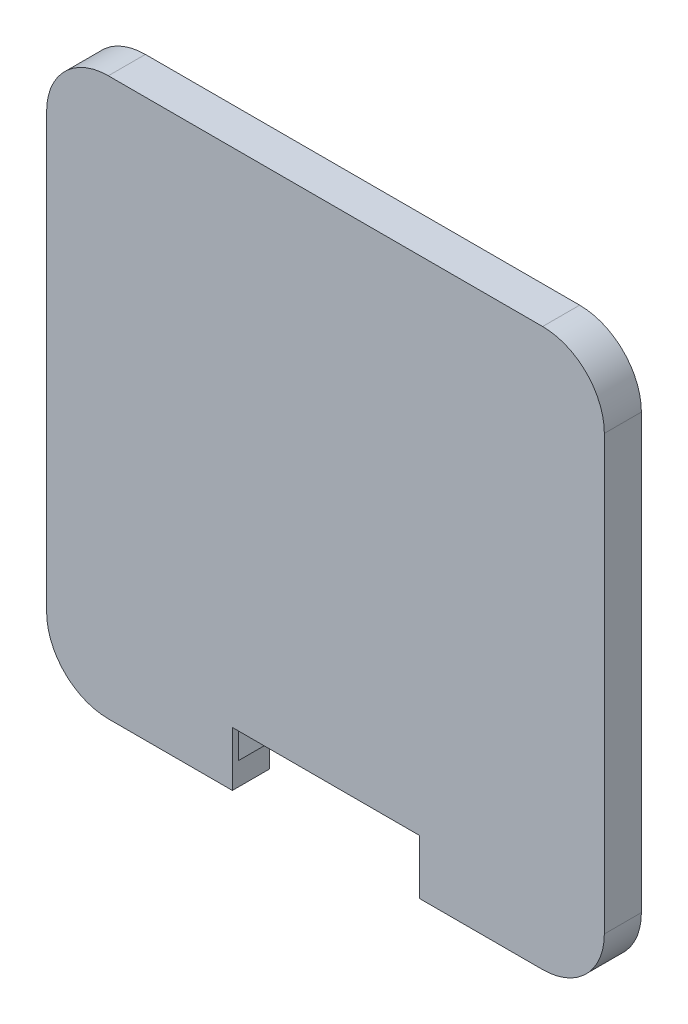
ISO-10303-21;
HEADER;
FILE_DESCRIPTION(('STEP AP214'),'2;1');
FILE_NAME('part.step','',(''),(''),'','','');
FILE_SCHEMA(('AUTOMOTIVE_DESIGN { 1 0 10303 214 1 1 1 1 }'));
ENDSEC;
DATA;
#1=APPLICATION_CONTEXT('core data for automotive mechanical design processes');
#2=APPLICATION_PROTOCOL_DEFINITION('international standard','automotive_design',2000,#1);
#3=PRODUCT_CONTEXT('',#1,'mechanical');
#4=PRODUCT('Part','Part','',(#3));
#5=PRODUCT_RELATED_PRODUCT_CATEGORY('part','',(#4));
#6=PRODUCT_DEFINITION_FORMATION('','',#4);
#7=PRODUCT_DEFINITION_CONTEXT('part definition',#1,'design');
#8=PRODUCT_DEFINITION('design','',#6,#7);
#9=PRODUCT_DEFINITION_SHAPE('','',#8);
#10=(LENGTH_UNIT() NAMED_UNIT(*) SI_UNIT(.MILLI.,.METRE.));
#11=(NAMED_UNIT(*) PLANE_ANGLE_UNIT() SI_UNIT($,.RADIAN.));
#12=(NAMED_UNIT(*) SI_UNIT($,.STERADIAN.) SOLID_ANGLE_UNIT());
#13=UNCERTAINTY_MEASURE_WITH_UNIT(LENGTH_MEASURE(1.E-05),#10,'distance_accuracy_value','');
#14=(GEOMETRIC_REPRESENTATION_CONTEXT(3) GLOBAL_UNCERTAINTY_ASSIGNED_CONTEXT((#13)) GLOBAL_UNIT_ASSIGNED_CONTEXT((#10,
#11,#12)) REPRESENTATION_CONTEXT('',''));
#15=CARTESIAN_POINT('',(0.,0.,0.));
#16=DIRECTION('',(0.,0.,1.));
#17=DIRECTION('',(1.,0.,0.));
#18=AXIS2_PLACEMENT_3D('',#15,#16,#17);
#19=CARTESIAN_POINT('',(24.9555,24.892,-5.));
#20=DIRECTION('',(0.,0.,1.));
#21=DIRECTION('',(1.,0.,0.));
#22=AXIS2_PLACEMENT_3D('',#19,#20,#21);
#23=CYLINDRICAL_SURFACE('',#22,5.23);
#24=CARTESIAN_POINT('',(24.9555,24.892,0.));
#25=DIRECTION('',(0.,0.,1.));
#26=DIRECTION('',(1.,0.,0.));
#27=AXIS2_PLACEMENT_3D('',#24,#25,#26);
#28=CIRCLE('',#27,5.23);
#29=CARTESIAN_POINT('',(30.1855,24.892,0.));
#30=VERTEX_POINT('',#29);
#31=CARTESIAN_POINT('',(24.9555,30.122,0.));
#32=VERTEX_POINT('',#31);
#33=EDGE_CURVE('E230',#30,#32,#28,.T.);
#34=ORIENTED_EDGE('',*,*,#33,.T.);
#35=DIRECTION('',(0.,0.,1.));
#36=VECTOR('',#35,1.);
#37=CARTESIAN_POINT('',(24.9555,30.122,-5.));
#38=LINE('',#37,#36);
#39=CARTESIAN_POINT('',(24.9555,30.122,-5.));
#40=VERTEX_POINT('',#39);
#41=EDGE_CURVE('E11',#40,#32,#38,.T.);
#42=ORIENTED_EDGE('',*,*,#41,.F.);
#43=CARTESIAN_POINT('',(24.9555,24.892,-5.));
#44=DIRECTION('',(0.,0.,1.));
#45=DIRECTION('',(1.,0.,0.));
#46=AXIS2_PLACEMENT_3D('',#43,#44,#45);
#47=CIRCLE('',#46,5.23);
#48=CARTESIAN_POINT('',(30.1855,24.892,-5.));
#49=VERTEX_POINT('',#48);
#50=EDGE_CURVE('E241',#49,#40,#47,.T.);
#51=ORIENTED_EDGE('',*,*,#50,.F.);
#52=DIRECTION('',(0.,0.,1.));
#53=VECTOR('',#52,1.);
#54=CARTESIAN_POINT('',(30.1855,24.892,-5.));
#55=LINE('',#54,#53);
#56=EDGE_CURVE('E44',#49,#30,#55,.T.);
#57=ORIENTED_EDGE('',*,*,#56,.T.);
#58=EDGE_LOOP('',(#34,#42,#51,#57));
#59=FACE_BOUND('',#58,.T.);
#60=ADVANCED_FACE('F41',(#59),#23,.F.);
#61=CARTESIAN_POINT('',(0.,30.122,-5.));
#62=DIRECTION('',(0.,1.,0.));
#63=DIRECTION('',(-1.,0.,0.));
#64=AXIS2_PLACEMENT_3D('',#61,#62,#63);
#65=PLANE('',#64);
#66=DIRECTION('',(-1.,0.,0.));
#67=VECTOR('',#66,1.);
#68=CARTESIAN_POINT('',(0.,30.122,0.));
#69=LINE('',#68,#67);
#70=CARTESIAN_POINT('',(-24.9555,30.122,0.));
#71=VERTEX_POINT('',#70);
#72=EDGE_CURVE('E245',#32,#71,#69,.T.);
#73=ORIENTED_EDGE('',*,*,#72,.T.);
#74=DIRECTION('',(0.,0.,1.));
#75=VECTOR('',#74,1.);
#76=CARTESIAN_POINT('',(-24.9555,30.122,-5.));
#77=LINE('',#76,#75);
#78=CARTESIAN_POINT('',(-24.9555,30.122,-5.));
#79=VERTEX_POINT('',#78);
#80=EDGE_CURVE('E51',#79,#71,#77,.T.);
#81=ORIENTED_EDGE('',*,*,#80,.F.);
#82=DIRECTION('',(-1.,0.,0.));
#83=VECTOR('',#82,1.);
#84=CARTESIAN_POINT('',(0.,30.122,-5.));
#85=LINE('',#84,#83);
#86=EDGE_CURVE('E58',#40,#79,#85,.T.);
#87=ORIENTED_EDGE('',*,*,#86,.F.);
#88=ORIENTED_EDGE('',*,*,#41,.T.);
#89=EDGE_LOOP('',(#73,#81,#87,#88));
#90=FACE_BOUND('',#89,.T.);
#91=ADVANCED_FACE('F544',(#90),#65,.F.);
#92=CARTESIAN_POINT('',(-24.9555,24.892,-5.));
#93=DIRECTION('',(0.,0.,1.));
#94=DIRECTION('',(1.,0.,0.));
#95=AXIS2_PLACEMENT_3D('',#92,#93,#94);
#96=CYLINDRICAL_SURFACE('',#95,5.23);
#97=CARTESIAN_POINT('',(-24.9555,24.892,0.));
#98=DIRECTION('',(0.,0.,1.));
#99=DIRECTION('',(1.,0.,0.));
#100=AXIS2_PLACEMENT_3D('',#97,#98,#99);
#101=CIRCLE('',#100,5.23);
#102=CARTESIAN_POINT('',(-30.1855,24.892,0.));
#103=VERTEX_POINT('',#102);
#104=EDGE_CURVE('E339',#71,#103,#101,.T.);
#105=ORIENTED_EDGE('',*,*,#104,.T.);
#106=DIRECTION('',(0.,0.,1.));
#107=VECTOR('',#106,1.);
#108=CARTESIAN_POINT('',(-30.1855,24.892,-5.));
#109=LINE('',#108,#107);
#110=CARTESIAN_POINT('',(-30.1855,24.892,-5.));
#111=VERTEX_POINT('',#110);
#112=EDGE_CURVE('E349',#111,#103,#109,.T.);
#113=ORIENTED_EDGE('',*,*,#112,.F.);
#114=CARTESIAN_POINT('',(-24.9555,24.892,-5.));
#115=DIRECTION('',(0.,0.,1.));
#116=DIRECTION('',(1.,0.,0.));
#117=AXIS2_PLACEMENT_3D('',#114,#115,#116);
#118=CIRCLE('',#117,5.23);
#119=EDGE_CURVE('E303',#79,#111,#118,.T.);
#120=ORIENTED_EDGE('',*,*,#119,.F.);
#121=ORIENTED_EDGE('',*,*,#80,.T.);
#122=EDGE_LOOP('',(#105,#113,#120,#121));
#123=FACE_BOUND('',#122,.T.);
#124=ADVANCED_FACE('F542',(#123),#96,.F.);
#125=CARTESIAN_POINT('',(-30.1855,0.,-5.));
#126=DIRECTION('',(-1.,0.,0.));
#127=DIRECTION('',(0.,0.,1.));
#128=AXIS2_PLACEMENT_3D('',#125,#126,#127);
#129=PLANE('',#128);
#130=DIRECTION('',(0.,-1.,0.));
#131=VECTOR('',#130,1.);
#132=CARTESIAN_POINT('',(-30.1855,0.,0.));
#133=LINE('',#132,#131);
#134=CARTESIAN_POINT('',(-30.1855,-24.892,0.));
#135=VERTEX_POINT('',#134);
#136=EDGE_CURVE('E335',#103,#135,#133,.T.);
#137=ORIENTED_EDGE('',*,*,#136,.T.);
#138=DIRECTION('',(0.,0.,1.));
#139=VECTOR('',#138,1.);
#140=CARTESIAN_POINT('',(-30.1855,-24.892,-5.));
#141=LINE('',#140,#139);
#142=CARTESIAN_POINT('',(-30.1855,-24.892,-5.));
#143=VERTEX_POINT('',#142);
#144=EDGE_CURVE('E353',#143,#135,#141,.T.);
#145=ORIENTED_EDGE('',*,*,#144,.F.);
#146=DIRECTION('',(0.,-1.,0.));
#147=VECTOR('',#146,1.);
#148=CARTESIAN_POINT('',(-30.1855,0.,-5.));
#149=LINE('',#148,#147);
#150=EDGE_CURVE('E300',#111,#143,#149,.T.);
#151=ORIENTED_EDGE('',*,*,#150,.F.);
#152=ORIENTED_EDGE('',*,*,#112,.T.);
#153=EDGE_LOOP('',(#137,#145,#151,#152));
#154=FACE_BOUND('',#153,.T.);
#155=ADVANCED_FACE('F538',(#154),#129,.F.);
#156=CARTESIAN_POINT('',(-24.9555,-24.892,-5.));
#157=DIRECTION('',(0.,0.,1.));
#158=DIRECTION('',(1.,0.,0.));
#159=AXIS2_PLACEMENT_3D('',#156,#157,#158);
#160=CYLINDRICAL_SURFACE('',#159,5.23);
#161=CARTESIAN_POINT('',(-24.9555,-24.892,0.));
#162=DIRECTION('',(0.,0.,1.));
#163=DIRECTION('',(1.,0.,0.));
#164=AXIS2_PLACEMENT_3D('',#161,#162,#163);
#165=CIRCLE('',#164,5.23);
#166=CARTESIAN_POINT('',(-24.9555,-30.122,0.));
#167=VERTEX_POINT('',#166);
#168=EDGE_CURVE('E331',#135,#167,#165,.T.);
#169=ORIENTED_EDGE('',*,*,#168,.T.);
#170=DIRECTION('',(0.,0.,1.));
#171=VECTOR('',#170,1.);
#172=CARTESIAN_POINT('',(-24.9555,-30.122,-5.));
#173=LINE('',#172,#171);
#174=CARTESIAN_POINT('',(-24.9555,-30.122,-5.));
#175=VERTEX_POINT('',#174);
#176=EDGE_CURVE('E357',#175,#167,#173,.T.);
#177=ORIENTED_EDGE('',*,*,#176,.F.);
#178=CARTESIAN_POINT('',(-24.9555,-24.892,-5.));
#179=DIRECTION('',(0.,0.,1.));
#180=DIRECTION('',(1.,0.,0.));
#181=AXIS2_PLACEMENT_3D('',#178,#179,#180);
#182=CIRCLE('',#181,5.23);
#183=EDGE_CURVE('E297',#143,#175,#182,.T.);
#184=ORIENTED_EDGE('',*,*,#183,.F.);
#185=ORIENTED_EDGE('',*,*,#144,.T.);
#186=EDGE_LOOP('',(#169,#177,#184,#185));
#187=FACE_BOUND('',#186,.T.);
#188=ADVANCED_FACE('F533',(#187),#160,.F.);
#189=CARTESIAN_POINT('',(0.,-30.122,-5.));
#190=DIRECTION('',(0.,-1.,0.));
#191=DIRECTION('',(1.,0.,0.));
#192=AXIS2_PLACEMENT_3D('',#189,#190,#191);
#193=PLANE('',#192);
#194=DIRECTION('',(1.,0.,0.));
#195=VECTOR('',#194,1.);
#196=CARTESIAN_POINT('',(0.,-30.122,0.));
#197=LINE('',#196,#195);
#198=CARTESIAN_POINT('',(-19.7221075529831,-30.122,0.));
#199=VERTEX_POINT('',#198);
#200=EDGE_CURVE('E327',#167,#199,#197,.T.);
#201=ORIENTED_EDGE('',*,*,#200,.T.);
#202=DIRECTION('',(0.,0.,1.));
#203=VECTOR('',#202,1.);
#204=CARTESIAN_POINT('',(-19.7221075529831,-30.122,-5.));
#205=LINE('',#204,#203);
#206=CARTESIAN_POINT('',(-19.7221075529831,-30.122,-5.));
#207=VERTEX_POINT('',#206);
#208=EDGE_CURVE('E361',#207,#199,#205,.T.);
#209=ORIENTED_EDGE('',*,*,#208,.F.);
#210=DIRECTION('',(1.,0.,0.));
#211=VECTOR('',#210,1.);
#212=CARTESIAN_POINT('',(0.,-30.122,-5.));
#213=LINE('',#212,#211);
#214=EDGE_CURVE('E294',#175,#207,#213,.T.);
#215=ORIENTED_EDGE('',*,*,#214,.F.);
#216=ORIENTED_EDGE('',*,*,#176,.T.);
#217=EDGE_LOOP('',(#201,#209,#215,#216));
#218=FACE_BOUND('',#217,.T.);
#219=ADVANCED_FACE('F530',(#218),#193,.F.);
#220=CARTESIAN_POINT('',(-27.4573939888341,-11.2606166358702,-5.));
#221=DIRECTION('',(-0.925215412371616,-0.37944227586027,0.));
#222=DIRECTION('',(0.37944227586027,-0.925215412371616,0.));
#223=AXIS2_PLACEMENT_3D('',#220,#221,#222);
#224=PLANE('',#223);
#225=DIRECTION('',(0.37944227586027,-0.925215412371616,0.));
#226=VECTOR('',#225,1.);
#227=CARTESIAN_POINT('',(-27.4573939888341,-11.2606166358702,0.));
#228=LINE('',#227,#226);
#229=CARTESIAN_POINT('',(-15.0866075529831,-41.425,0.));
#230=VERTEX_POINT('',#229);
#231=EDGE_CURVE('E323',#199,#230,#228,.T.);
#232=ORIENTED_EDGE('',*,*,#231,.T.);
#233=DIRECTION('',(0.,0.,1.));
#234=VECTOR('',#233,1.);
#235=CARTESIAN_POINT('',(-15.0866075529831,-41.425,-5.));
#236=LINE('',#235,#234);
#237=CARTESIAN_POINT('',(-15.0866075529831,-41.425,-5.));
#238=VERTEX_POINT('',#237);
#239=EDGE_CURVE('E365',#238,#230,#236,.T.);
#240=ORIENTED_EDGE('',*,*,#239,.F.);
#241=DIRECTION('',(0.37944227586027,-0.925215412371616,0.));
#242=VECTOR('',#241,1.);
#243=CARTESIAN_POINT('',(-27.4573939888341,-11.2606166358702,-5.));
#244=LINE('',#243,#242);
#245=EDGE_CURVE('E291',#207,#238,#244,.T.);
#246=ORIENTED_EDGE('',*,*,#245,.F.);
#247=ORIENTED_EDGE('',*,*,#208,.T.);
#248=EDGE_LOOP('',(#232,#240,#246,#247));
#249=FACE_BOUND('',#248,.T.);
#250=ADVANCED_FACE('F525',(#249),#224,.F.);
#251=CARTESIAN_POINT('',(-15.0866075529831,0.,-5.));
#252=DIRECTION('',(-1.,0.,0.));
#253=DIRECTION('',(0.,0.,1.));
#254=AXIS2_PLACEMENT_3D('',#251,#252,#253);
#255=PLANE('',#254);
#256=ORIENTED_EDGE('',*,*,#239,.T.);
#257=DIRECTION('',(0.,1.,0.));
#258=VECTOR('',#257,1.);
#259=CARTESIAN_POINT('',(-15.0866075529831,0.,0.));
#260=LINE('',#259,#258);
#261=CARTESIAN_POINT('',(-15.0866075529831,-36.275,0.));
#262=VERTEX_POINT('',#261);
#263=EDGE_CURVE('E224',#230,#262,#260,.T.);
#264=ORIENTED_EDGE('',*,*,#263,.T.);
#265=DIRECTION('',(0.,0.,-1.));
#266=VECTOR('',#265,1.);
#267=CARTESIAN_POINT('',(-15.0866075529831,-36.275,1.));
#268=LINE('',#267,#266);
#269=CARTESIAN_POINT('',(-15.0866075529831,-36.275,1.));
#270=VERTEX_POINT('',#269);
#271=EDGE_CURVE('E231',#270,#262,#268,.T.);
#272=ORIENTED_EDGE('',*,*,#271,.F.);
#273=DIRECTION('',(0.,1.,0.));
#274=VECTOR('',#273,1.);
#275=CARTESIAN_POINT('',(-15.0866075529831,0.,1.));
#276=LINE('',#275,#274);
#277=CARTESIAN_POINT('',(-15.0866075529831,-45.122,1.));
#278=VERTEX_POINT('',#277);
#279=EDGE_CURVE('E219',#278,#270,#276,.T.);
#280=ORIENTED_EDGE('',*,*,#279,.F.);
#281=DIRECTION('',(0.,0.,1.));
#282=VECTOR('',#281,1.);
#283=CARTESIAN_POINT('',(-15.0866075529831,-45.122,-5.));
#284=LINE('',#283,#282);
#285=CARTESIAN_POINT('',(-15.0866075529831,-45.122,-5.));
#286=VERTEX_POINT('',#285);
#287=EDGE_CURVE('E369',#286,#278,#284,.T.);
#288=ORIENTED_EDGE('',*,*,#287,.F.);
#289=DIRECTION('',(0.,-1.,0.));
#290=VECTOR('',#289,1.);
#291=CARTESIAN_POINT('',(-15.0866075529831,0.,-5.));
#292=LINE('',#291,#290);
#293=EDGE_CURVE('E288',#238,#286,#292,.T.);
#294=ORIENTED_EDGE('',*,*,#293,.F.);
#295=EDGE_LOOP('',(#256,#264,#272,#280,#288,#294));
#296=FACE_BOUND('',#295,.T.);
#297=ADVANCED_FACE('F522',(#296),#255,.F.);
#298=CARTESIAN_POINT('',(0.,-45.122,-5.));
#299=DIRECTION('',(0.,-1.,0.));
#300=DIRECTION('',(0.,0.,-1.));
#301=AXIS2_PLACEMENT_3D('',#298,#299,#300);
#302=PLANE('',#301);
#303=ORIENTED_EDGE('',*,*,#287,.T.);
#304=DIRECTION('',(1.,0.,0.));
#305=VECTOR('',#304,1.);
#306=CARTESIAN_POINT('',(0.,-45.122,1.));
#307=LINE('',#306,#305);
#308=CARTESIAN_POINT('',(-35.1854999999999,-45.122,1.));
#309=VERTEX_POINT('',#308);
#310=EDGE_CURVE('E445',#309,#278,#307,.T.);
#311=ORIENTED_EDGE('',*,*,#310,.F.);
#312=DIRECTION('',(0.,0.,1.));
#313=VECTOR('',#312,1.);
#314=CARTESIAN_POINT('',(-35.1854999999999,-45.122,-5.));
#315=LINE('',#314,#313);
#316=CARTESIAN_POINT('',(-35.1854999999999,-45.122,-5.));
#317=VERTEX_POINT('',#316);
#318=EDGE_CURVE('E372',#317,#309,#315,.T.);
#319=ORIENTED_EDGE('',*,*,#318,.F.);
#320=DIRECTION('',(1.,0.,0.));
#321=VECTOR('',#320,1.);
#322=CARTESIAN_POINT('',(0.,-45.122,-5.));
#323=LINE('',#322,#321);
#324=EDGE_CURVE('E265',#317,#286,#323,.T.);
#325=ORIENTED_EDGE('',*,*,#324,.T.);
#326=EDGE_LOOP('',(#303,#311,#319,#325));
#327=FACE_BOUND('',#326,.T.);
#328=ADVANCED_FACE('F517',(#327),#302,.T.);
#329=CARTESIAN_POINT('',(-35.1855,-35.122,-5.));
#330=DIRECTION('',(0.,0.,1.));
#331=DIRECTION('',(1.,0.,0.));
#332=AXIS2_PLACEMENT_3D('',#329,#330,#331);
#333=CYLINDRICAL_SURFACE('',#332,9.99999999999999);
#334=ORIENTED_EDGE('',*,*,#318,.T.);
#335=CARTESIAN_POINT('',(-35.1855,-35.122,1.));
#336=DIRECTION('',(0.,0.,1.));
#337=DIRECTION('',(1.,0.,0.));
#338=AXIS2_PLACEMENT_3D('',#335,#336,#337);
#339=CIRCLE('',#338,9.99999999999999);
#340=CARTESIAN_POINT('',(-45.1855,-35.1219999999999,1.));
#341=VERTEX_POINT('',#340);
#342=EDGE_CURVE('E448',#341,#309,#339,.T.);
#343=ORIENTED_EDGE('',*,*,#342,.F.);
#344=DIRECTION('',(0.,0.,1.));
#345=VECTOR('',#344,1.);
#346=CARTESIAN_POINT('',(-45.1855,-35.1219999999999,-5.));
#347=LINE('',#346,#345);
#348=CARTESIAN_POINT('',(-45.1855,-35.1219999999999,-5.));
#349=VERTEX_POINT('',#348);
#350=EDGE_CURVE('E375',#349,#341,#347,.T.);
#351=ORIENTED_EDGE('',*,*,#350,.F.);
#352=CARTESIAN_POINT('',(-35.1855,-35.122,-5.));
#353=DIRECTION('',(0.,0.,1.));
#354=DIRECTION('',(1.,0.,0.));
#355=AXIS2_PLACEMENT_3D('',#352,#353,#354);
#356=CIRCLE('',#355,9.99999999999999);
#357=EDGE_CURVE('E285',#317,#349,#356,.F.);
#358=ORIENTED_EDGE('',*,*,#357,.F.);
#359=EDGE_LOOP('',(#334,#343,#351,#358));
#360=FACE_BOUND('',#359,.T.);
#361=ADVANCED_FACE('F513',(#360),#333,.T.);
#362=CARTESIAN_POINT('',(-45.1855,0.,-5.));
#363=DIRECTION('',(1.,0.,0.));
#364=DIRECTION('',(0.,0.,-1.));
#365=AXIS2_PLACEMENT_3D('',#362,#363,#364);
#366=PLANE('',#365);
#367=ORIENTED_EDGE('',*,*,#350,.T.);
#368=DIRECTION('',(0.,-1.,0.));
#369=VECTOR('',#368,1.);
#370=CARTESIAN_POINT('',(-45.1855,0.,1.));
#371=LINE('',#370,#369);
#372=CARTESIAN_POINT('',(-45.1855,35.1219999999999,1.));
#373=VERTEX_POINT('',#372);
#374=EDGE_CURVE('E452',#373,#341,#371,.T.);
#375=ORIENTED_EDGE('',*,*,#374,.F.);
#376=DIRECTION('',(0.,0.,1.));
#377=VECTOR('',#376,1.);
#378=CARTESIAN_POINT('',(-45.1855,35.1219999999999,-5.));
#379=LINE('',#378,#377);
#380=CARTESIAN_POINT('',(-45.1855,35.1219999999999,-5.));
#381=VERTEX_POINT('',#380);
#382=EDGE_CURVE('E378',#381,#373,#379,.T.);
#383=ORIENTED_EDGE('',*,*,#382,.F.);
#384=DIRECTION('',(0.,1.,0.));
#385=VECTOR('',#384,1.);
#386=CARTESIAN_POINT('',(-45.1855,0.,-5.));
#387=LINE('',#386,#385);
#388=EDGE_CURVE('E282',#349,#381,#387,.T.);
#389=ORIENTED_EDGE('',*,*,#388,.F.);
#390=EDGE_LOOP('',(#367,#375,#383,#389));
#391=FACE_BOUND('',#390,.T.);
#392=ADVANCED_FACE('F508',(#391),#366,.F.);
#393=CARTESIAN_POINT('',(-35.1855,35.122,-5.));
#394=DIRECTION('',(0.,0.,1.));
#395=DIRECTION('',(1.,0.,0.));
#396=AXIS2_PLACEMENT_3D('',#393,#394,#395);
#397=CYLINDRICAL_SURFACE('',#396,9.99999999999999);
#398=ORIENTED_EDGE('',*,*,#382,.T.);
#399=CARTESIAN_POINT('',(-35.1855,35.122,1.));
#400=DIRECTION('',(0.,0.,1.));
#401=DIRECTION('',(1.,0.,0.));
#402=AXIS2_PLACEMENT_3D('',#399,#400,#401);
#403=CIRCLE('',#402,9.99999999999999);
#404=CARTESIAN_POINT('',(-35.1854999999999,45.122,1.));
#405=VERTEX_POINT('',#404);
#406=EDGE_CURVE('E456',#405,#373,#403,.T.);
#407=ORIENTED_EDGE('',*,*,#406,.F.);
#408=DIRECTION('',(0.,0.,1.));
#409=VECTOR('',#408,1.);
#410=CARTESIAN_POINT('',(-35.1854999999999,45.122,-5.));
#411=LINE('',#410,#409);
#412=CARTESIAN_POINT('',(-35.1854999999999,45.122,-5.));
#413=VERTEX_POINT('',#412);
#414=EDGE_CURVE('E381',#413,#405,#411,.T.);
#415=ORIENTED_EDGE('',*,*,#414,.F.);
#416=CARTESIAN_POINT('',(-35.1855,35.122,-5.));
#417=DIRECTION('',(0.,0.,1.));
#418=DIRECTION('',(1.,0.,0.));
#419=AXIS2_PLACEMENT_3D('',#416,#417,#418);
#420=CIRCLE('',#419,9.99999999999999);
#421=EDGE_CURVE('E279',#381,#413,#420,.F.);
#422=ORIENTED_EDGE('',*,*,#421,.F.);
#423=EDGE_LOOP('',(#398,#407,#415,#422));
#424=FACE_BOUND('',#423,.T.);
#425=ADVANCED_FACE('F503',(#424),#397,.T.);
#426=CARTESIAN_POINT('',(0.,45.122,-5.));
#427=DIRECTION('',(0.,-1.,0.));
#428=DIRECTION('',(0.,0.,-1.));
#429=AXIS2_PLACEMENT_3D('',#426,#427,#428);
#430=PLANE('',#429);
#431=ORIENTED_EDGE('',*,*,#414,.T.);
#432=DIRECTION('',(-1.,0.,0.));
#433=VECTOR('',#432,1.);
#434=CARTESIAN_POINT('',(0.,45.122,1.));
#435=LINE('',#434,#433);
#436=CARTESIAN_POINT('',(35.1854999999999,45.122,1.));
#437=VERTEX_POINT('',#436);
#438=EDGE_CURVE('E460',#437,#405,#435,.T.);
#439=ORIENTED_EDGE('',*,*,#438,.F.);
#440=DIRECTION('',(0.,0.,1.));
#441=VECTOR('',#440,1.);
#442=CARTESIAN_POINT('',(35.1854999999999,45.122,-5.));
#443=LINE('',#442,#441);
#444=CARTESIAN_POINT('',(35.1854999999999,45.122,-5.));
#445=VERTEX_POINT('',#444);
#446=EDGE_CURVE('E384',#445,#437,#443,.T.);
#447=ORIENTED_EDGE('',*,*,#446,.F.);
#448=DIRECTION('',(1.,0.,0.));
#449=VECTOR('',#448,1.);
#450=CARTESIAN_POINT('',(0.,45.122,-5.));
#451=LINE('',#450,#449);
#452=EDGE_CURVE('E276',#413,#445,#451,.T.);
#453=ORIENTED_EDGE('',*,*,#452,.F.);
#454=EDGE_LOOP('',(#431,#439,#447,#453));
#455=FACE_BOUND('',#454,.T.);
#456=ADVANCED_FACE('F499',(#455),#430,.F.);
#457=CARTESIAN_POINT('',(35.1855,35.122,-5.));
#458=DIRECTION('',(0.,0.,1.));
#459=DIRECTION('',(1.,0.,0.));
#460=AXIS2_PLACEMENT_3D('',#457,#458,#459);
#461=CYLINDRICAL_SURFACE('',#460,9.99999999999999);
#462=ORIENTED_EDGE('',*,*,#446,.T.);
#463=CARTESIAN_POINT('',(35.1855,35.122,1.));
#464=DIRECTION('',(0.,0.,1.));
#465=DIRECTION('',(1.,0.,0.));
#466=AXIS2_PLACEMENT_3D('',#463,#464,#465);
#467=CIRCLE('',#466,9.99999999999999);
#468=CARTESIAN_POINT('',(45.1855,35.122,1.));
#469=VERTEX_POINT('',#468);
#470=EDGE_CURVE('E464',#469,#437,#467,.T.);
#471=ORIENTED_EDGE('',*,*,#470,.F.);
#472=DIRECTION('',(0.,0.,1.));
#473=VECTOR('',#472,1.);
#474=CARTESIAN_POINT('',(45.1855,35.1219999999999,-5.));
#475=LINE('',#474,#473);
#476=CARTESIAN_POINT('',(45.1855,35.1219999999999,-5.));
#477=VERTEX_POINT('',#476);
#478=EDGE_CURVE('E387',#477,#469,#475,.T.);
#479=ORIENTED_EDGE('',*,*,#478,.F.);
#480=CARTESIAN_POINT('',(35.1855,35.122,-5.));
#481=DIRECTION('',(0.,0.,1.));
#482=DIRECTION('',(1.,0.,0.));
#483=AXIS2_PLACEMENT_3D('',#480,#481,#482);
#484=CIRCLE('',#483,9.99999999999999);
#485=EDGE_CURVE('E273',#445,#477,#484,.F.);
#486=ORIENTED_EDGE('',*,*,#485,.F.);
#487=EDGE_LOOP('',(#462,#471,#479,#486));
#488=FACE_BOUND('',#487,.T.);
#489=ADVANCED_FACE('F495',(#488),#461,.T.);
#490=CARTESIAN_POINT('',(45.1855,0.,-5.));
#491=DIRECTION('',(1.,0.,0.));
#492=DIRECTION('',(0.,0.,-1.));
#493=AXIS2_PLACEMENT_3D('',#490,#491,#492);
#494=PLANE('',#493);
#495=ORIENTED_EDGE('',*,*,#478,.T.);
#496=DIRECTION('',(0.,1.,0.));
#497=VECTOR('',#496,1.);
#498=CARTESIAN_POINT('',(45.1855,0.,1.));
#499=LINE('',#498,#497);
#500=CARTESIAN_POINT('',(45.1855,-35.1219999999999,1.));
#501=VERTEX_POINT('',#500);
#502=EDGE_CURVE('E468',#501,#469,#499,.T.);
#503=ORIENTED_EDGE('',*,*,#502,.F.);
#504=DIRECTION('',(0.,0.,1.));
#505=VECTOR('',#504,1.);
#506=CARTESIAN_POINT('',(45.1855,-35.1219999999999,-5.));
#507=LINE('',#506,#505);
#508=CARTESIAN_POINT('',(45.1855,-35.1219999999999,-5.));
#509=VERTEX_POINT('',#508);
#510=EDGE_CURVE('E390',#509,#501,#507,.T.);
#511=ORIENTED_EDGE('',*,*,#510,.F.);
#512=DIRECTION('',(0.,1.,0.));
#513=VECTOR('',#512,1.);
#514=CARTESIAN_POINT('',(45.1855,0.,-5.));
#515=LINE('',#514,#513);
#516=EDGE_CURVE('E269',#509,#477,#515,.T.);
#517=ORIENTED_EDGE('',*,*,#516,.T.);
#518=EDGE_LOOP('',(#495,#503,#511,#517));
#519=FACE_BOUND('',#518,.T.);
#520=ADVANCED_FACE('F485',(#519),#494,.T.);
#521=CARTESIAN_POINT('',(35.1855,-35.122,-5.));
#522=DIRECTION('',(0.,0.,1.));
#523=DIRECTION('',(1.,0.,0.));
#524=AXIS2_PLACEMENT_3D('',#521,#522,#523);
#525=CYLINDRICAL_SURFACE('',#524,9.99999999999999);
#526=ORIENTED_EDGE('',*,*,#510,.T.);
#527=CARTESIAN_POINT('',(35.1855,-35.122,1.));
#528=DIRECTION('',(0.,0.,1.));
#529=DIRECTION('',(1.,0.,0.));
#530=AXIS2_PLACEMENT_3D('',#527,#528,#529);
#531=CIRCLE('',#530,9.99999999999999);
#532=CARTESIAN_POINT('',(35.1854999999999,-45.122,1.));
#533=VERTEX_POINT('',#532);
#534=EDGE_CURVE('E472',#533,#501,#531,.T.);
#535=ORIENTED_EDGE('',*,*,#534,.F.);
#536=DIRECTION('',(0.,0.,1.));
#537=VECTOR('',#536,1.);
#538=CARTESIAN_POINT('',(35.1854999999999,-45.122,-5.));
#539=LINE('',#538,#537);
#540=CARTESIAN_POINT('',(35.1854999999999,-45.122,-5.));
#541=VERTEX_POINT('',#540);
#542=EDGE_CURVE('E393',#541,#533,#539,.T.);
#543=ORIENTED_EDGE('',*,*,#542,.F.);
#544=CARTESIAN_POINT('',(35.1855,-35.122,-5.));
#545=DIRECTION('',(0.,0.,1.));
#546=DIRECTION('',(1.,0.,0.));
#547=AXIS2_PLACEMENT_3D('',#544,#545,#546);
#548=CIRCLE('',#547,9.99999999999999);
#549=EDGE_CURVE('E264',#541,#509,#548,.T.);
#550=ORIENTED_EDGE('',*,*,#549,.T.);
#551=EDGE_LOOP('',(#526,#535,#543,#550));
#552=FACE_BOUND('',#551,.T.);
#553=ADVANCED_FACE('F481',(#552),#525,.T.);
#554=ORIENTED_EDGE('',*,*,#542,.T.);
#555=DIRECTION('',(1.,0.,0.));
#556=VECTOR('',#555,1.);
#557=CARTESIAN_POINT('',(0.,-45.122,1.));
#558=LINE('',#557,#556);
#559=CARTESIAN_POINT('',(15.2146609654219,-45.122,1.));
#560=VERTEX_POINT('',#559);
#561=EDGE_CURVE('E212',#560,#533,#558,.T.);
#562=ORIENTED_EDGE('',*,*,#561,.F.);
#563=DIRECTION('',(0.,0.,1.));
#564=VECTOR('',#563,1.);
#565=CARTESIAN_POINT('',(15.2146609654219,-45.122,-5.));
#566=LINE('',#565,#564);
#567=CARTESIAN_POINT('',(15.2146609654219,-45.122,-5.));
#568=VERTEX_POINT('',#567);
#569=EDGE_CURVE('E207',#568,#560,#566,.T.);
#570=ORIENTED_EDGE('',*,*,#569,.F.);
#571=EDGE_CURVE('E260',#568,#541,#323,.T.);
#572=ORIENTED_EDGE('',*,*,#571,.T.);
#573=EDGE_LOOP('',(#554,#562,#570,#572));
#574=FACE_BOUND('',#573,.T.);
#575=ADVANCED_FACE('F567',(#574),#302,.T.);
#576=CARTESIAN_POINT('',(15.2146609654219,0.,-5.));
#577=DIRECTION('',(-1.,0.,0.));
#578=DIRECTION('',(0.,0.,1.));
#579=AXIS2_PLACEMENT_3D('',#576,#577,#578);
#580=PLANE('',#579);
#581=ORIENTED_EDGE('',*,*,#569,.T.);
#582=DIRECTION('',(0.,-1.,0.));
#583=VECTOR('',#582,1.);
#584=CARTESIAN_POINT('',(15.2146609654219,0.,1.));
#585=LINE('',#584,#583);
#586=CARTESIAN_POINT('',(15.2146609654219,-36.275,1.));
#587=VERTEX_POINT('',#586);
#588=EDGE_CURVE('E199',#587,#560,#585,.T.);
#589=ORIENTED_EDGE('',*,*,#588,.F.);
#590=DIRECTION('',(0.,0.,-1.));
#591=VECTOR('',#590,1.);
#592=CARTESIAN_POINT('',(15.2146609654219,-36.275,1.));
#593=LINE('',#592,#591);
#594=CARTESIAN_POINT('',(15.2146609654219,-36.275,0.));
#595=VERTEX_POINT('',#594);
#596=EDGE_CURVE('E204',#587,#595,#593,.T.);
#597=ORIENTED_EDGE('',*,*,#596,.T.);
#598=DIRECTION('',(0.,-1.,0.));
#599=VECTOR('',#598,1.);
#600=CARTESIAN_POINT('',(15.2146609654219,0.,0.));
#601=LINE('',#600,#599);
#602=CARTESIAN_POINT('',(15.2146609654219,-41.425,0.));
#603=VERTEX_POINT('',#602);
#604=EDGE_CURVE('E436',#595,#603,#601,.T.);
#605=ORIENTED_EDGE('',*,*,#604,.T.);
#606=DIRECTION('',(0.,0.,1.));
#607=VECTOR('',#606,1.);
#608=CARTESIAN_POINT('',(15.2146609654219,-41.425,-5.));
#609=LINE('',#608,#607);
#610=CARTESIAN_POINT('',(15.2146609654219,-41.425,-5.));
#611=VERTEX_POINT('',#610);
#612=EDGE_CURVE('E398',#611,#603,#609,.T.);
#613=ORIENTED_EDGE('',*,*,#612,.F.);
#614=DIRECTION('',(0.,-1.,0.));
#615=VECTOR('',#614,1.);
#616=CARTESIAN_POINT('',(15.2146609654219,0.,-5.));
#617=LINE('',#616,#615);
#618=EDGE_CURVE('E257',#611,#568,#617,.T.);
#619=ORIENTED_EDGE('',*,*,#618,.T.);
#620=EDGE_LOOP('',(#581,#589,#597,#605,#613,#619));
#621=FACE_BOUND('',#620,.T.);
#622=ADVANCED_FACE('F201',(#621),#580,.T.);
#623=CARTESIAN_POINT('',(27.3816328938987,-10.9218872779034,-5.));
#624=DIRECTION('',(0.928836129508278,-0.37049081570274,0.));
#625=DIRECTION('',(0.37049081570274,0.928836129508278,0.));
#626=AXIS2_PLACEMENT_3D('',#623,#624,#625);
#627=PLANE('',#626);
#628=DIRECTION('',(0.37049081570274,0.928836129508278,0.));
#629=VECTOR('',#628,1.);
#630=CARTESIAN_POINT('',(27.3816328938987,-10.9218872779034,0.));
#631=LINE('',#630,#629);
#632=CARTESIAN_POINT('',(19.7231609654219,-30.122,0.));
#633=VERTEX_POINT('',#632);
#634=EDGE_CURVE('E319',#603,#633,#631,.T.);
#635=ORIENTED_EDGE('',*,*,#634,.T.);
#636=DIRECTION('',(0.,0.,1.));
#637=VECTOR('',#636,1.);
#638=CARTESIAN_POINT('',(19.7231609654219,-30.122,-5.));
#639=LINE('',#638,#637);
#640=CARTESIAN_POINT('',(19.7231609654219,-30.122,-5.));
#641=VERTEX_POINT('',#640);
#642=EDGE_CURVE('E402',#641,#633,#639,.T.);
#643=ORIENTED_EDGE('',*,*,#642,.F.);
#644=DIRECTION('',(0.37049081570274,0.928836129508278,0.));
#645=VECTOR('',#644,1.);
#646=CARTESIAN_POINT('',(27.3816328938987,-10.9218872779034,-5.));
#647=LINE('',#646,#645);
#648=EDGE_CURVE('E254',#611,#641,#647,.T.);
#649=ORIENTED_EDGE('',*,*,#648,.F.);
#650=ORIENTED_EDGE('',*,*,#612,.T.);
#651=EDGE_LOOP('',(#635,#643,#649,#650));
#652=FACE_BOUND('',#651,.T.);
#653=ADVANCED_FACE('F433',(#652),#627,.F.);
#654=CARTESIAN_POINT('',(0.,-30.122,-5.));
#655=DIRECTION('',(0.,-1.,0.));
#656=DIRECTION('',(1.,0.,0.));
#657=AXIS2_PLACEMENT_3D('',#654,#655,#656);
#658=PLANE('',#657);
#659=DIRECTION('',(1.,0.,0.));
#660=VECTOR('',#659,1.);
#661=CARTESIAN_POINT('',(0.,-30.122,0.));
#662=LINE('',#661,#660);
#663=CARTESIAN_POINT('',(24.9555,-30.122,0.));
#664=VERTEX_POINT('',#663);
#665=EDGE_CURVE('E315',#633,#664,#662,.T.);
#666=ORIENTED_EDGE('',*,*,#665,.T.);
#667=DIRECTION('',(0.,0.,1.));
#668=VECTOR('',#667,1.);
#669=CARTESIAN_POINT('',(24.9555,-30.122,-5.));
#670=LINE('',#669,#668);
#671=CARTESIAN_POINT('',(24.9555,-30.122,-5.));
#672=VERTEX_POINT('',#671);
#673=EDGE_CURVE('E406',#672,#664,#670,.T.);
#674=ORIENTED_EDGE('',*,*,#673,.F.);
#675=DIRECTION('',(1.,0.,0.));
#676=VECTOR('',#675,1.);
#677=CARTESIAN_POINT('',(0.,-30.122,-5.));
#678=LINE('',#677,#676);
#679=EDGE_CURVE('E251',#641,#672,#678,.T.);
#680=ORIENTED_EDGE('',*,*,#679,.F.);
#681=ORIENTED_EDGE('',*,*,#642,.T.);
#682=EDGE_LOOP('',(#666,#674,#680,#681));
#683=FACE_BOUND('',#682,.T.);
#684=ADVANCED_FACE('F430',(#683),#658,.F.);
#685=CARTESIAN_POINT('',(24.9555,-24.892,-5.));
#686=DIRECTION('',(0.,0.,1.));
#687=DIRECTION('',(1.,0.,0.));
#688=AXIS2_PLACEMENT_3D('',#685,#686,#687);
#689=CYLINDRICAL_SURFACE('',#688,5.23);
#690=CARTESIAN_POINT('',(24.9555,-24.892,0.));
#691=DIRECTION('',(0.,0.,1.));
#692=DIRECTION('',(1.,0.,0.));
#693=AXIS2_PLACEMENT_3D('',#690,#691,#692);
#694=CIRCLE('',#693,5.23);
#695=CARTESIAN_POINT('',(30.1855,-24.892,0.));
#696=VERTEX_POINT('',#695);
#697=EDGE_CURVE('E311',#664,#696,#694,.T.);
#698=ORIENTED_EDGE('',*,*,#697,.T.);
#699=DIRECTION('',(0.,0.,1.));
#700=VECTOR('',#699,1.);
#701=CARTESIAN_POINT('',(30.1855,-24.892,-5.));
#702=LINE('',#701,#700);
#703=CARTESIAN_POINT('',(30.1855,-24.892,-5.));
#704=VERTEX_POINT('',#703);
#705=EDGE_CURVE('E409',#704,#696,#702,.T.);
#706=ORIENTED_EDGE('',*,*,#705,.F.);
#707=CARTESIAN_POINT('',(24.9555,-24.892,-5.));
#708=DIRECTION('',(0.,0.,1.));
#709=DIRECTION('',(1.,0.,0.));
#710=AXIS2_PLACEMENT_3D('',#707,#708,#709);
#711=CIRCLE('',#710,5.23);
#712=EDGE_CURVE('E248',#672,#704,#711,.T.);
#713=ORIENTED_EDGE('',*,*,#712,.F.);
#714=ORIENTED_EDGE('',*,*,#673,.T.);
#715=EDGE_LOOP('',(#698,#706,#713,#714));
#716=FACE_BOUND('',#715,.T.);
#717=ADVANCED_FACE('F425',(#716),#689,.F.);
#718=CARTESIAN_POINT('',(30.1855,0.,-5.));
#719=DIRECTION('',(1.,0.,0.));
#720=DIRECTION('',(0.,1.,0.));
#721=AXIS2_PLACEMENT_3D('',#718,#719,#720);
#722=PLANE('',#721);
#723=DIRECTION('',(0.,1.,0.));
#724=VECTOR('',#723,1.);
#725=CARTESIAN_POINT('',(30.1855,0.,0.));
#726=LINE('',#725,#724);
#727=EDGE_CURVE('E236',#696,#30,#726,.T.);
#728=ORIENTED_EDGE('',*,*,#727,.T.);
#729=ORIENTED_EDGE('',*,*,#56,.F.);
#730=DIRECTION('',(0.,1.,0.));
#731=VECTOR('',#730,1.);
#732=CARTESIAN_POINT('',(30.1855,0.,-5.));
#733=LINE('',#732,#731);
#734=EDGE_CURVE('E244',#704,#49,#733,.T.);
#735=ORIENTED_EDGE('',*,*,#734,.F.);
#736=ORIENTED_EDGE('',*,*,#705,.T.);
#737=EDGE_LOOP('',(#728,#729,#735,#736));
#738=FACE_BOUND('',#737,.T.);
#739=ADVANCED_FACE('F421',(#738),#722,.F.);
#740=CARTESIAN_POINT('',(0.,0.,-5.));
#741=DIRECTION('',(0.,0.,1.));
#742=DIRECTION('',(1.,0.,0.));
#743=AXIS2_PLACEMENT_3D('',#740,#741,#742);
#744=PLANE('',#743);
#745=ORIENTED_EDGE('',*,*,#50,.T.);
#746=ORIENTED_EDGE('',*,*,#86,.T.);
#747=ORIENTED_EDGE('',*,*,#119,.T.);
#748=ORIENTED_EDGE('',*,*,#150,.T.);
#749=ORIENTED_EDGE('',*,*,#183,.T.);
#750=ORIENTED_EDGE('',*,*,#214,.T.);
#751=ORIENTED_EDGE('',*,*,#245,.T.);
#752=ORIENTED_EDGE('',*,*,#293,.T.);
#753=ORIENTED_EDGE('',*,*,#324,.F.);
#754=ORIENTED_EDGE('',*,*,#357,.T.);
#755=ORIENTED_EDGE('',*,*,#388,.T.);
#756=ORIENTED_EDGE('',*,*,#421,.T.);
#757=ORIENTED_EDGE('',*,*,#452,.T.);
#758=ORIENTED_EDGE('',*,*,#485,.T.);
#759=ORIENTED_EDGE('',*,*,#516,.F.);
#760=ORIENTED_EDGE('',*,*,#549,.F.);
#761=ORIENTED_EDGE('',*,*,#571,.F.);
#762=ORIENTED_EDGE('',*,*,#618,.F.);
#763=ORIENTED_EDGE('',*,*,#648,.T.);
#764=ORIENTED_EDGE('',*,*,#679,.T.);
#765=ORIENTED_EDGE('',*,*,#712,.T.);
#766=ORIENTED_EDGE('',*,*,#734,.T.);
#767=EDGE_LOOP('',(#745,#746,#747,#748,#749,#750,#751,#752,#753,#754,#755,#756,#757,#758,#759,
#760,#761,#762,#763,#764,#765,#766));
#768=FACE_BOUND('',#767,.T.);
#769=ADVANCED_FACE('F487',(#768),#744,.F.);
#770=CARTESIAN_POINT('',(0.,-36.275,1.));
#771=DIRECTION('',(0.,1.,0.));
#772=DIRECTION('',(0.,0.,1.));
#773=AXIS2_PLACEMENT_3D('',#770,#771,#772);
#774=PLANE('',#773);
#775=DIRECTION('',(1.,0.,0.));
#776=VECTOR('',#775,1.);
#777=CARTESIAN_POINT('',(0.,-36.275,0.));
#778=LINE('',#777,#776);
#779=EDGE_CURVE('E228',#262,#595,#778,.T.);
#780=ORIENTED_EDGE('',*,*,#779,.T.);
#781=ORIENTED_EDGE('',*,*,#596,.F.);
#782=DIRECTION('',(1.,0.,0.));
#783=VECTOR('',#782,1.);
#784=CARTESIAN_POINT('',(0.,-36.275,1.));
#785=LINE('',#784,#783);
#786=EDGE_CURVE('E213',#270,#587,#785,.T.);
#787=ORIENTED_EDGE('',*,*,#786,.F.);
#788=ORIENTED_EDGE('',*,*,#271,.T.);
#789=EDGE_LOOP('',(#780,#781,#787,#788));
#790=FACE_BOUND('',#789,.T.);
#791=ADVANCED_FACE('F226',(#790),#774,.F.);
#792=CARTESIAN_POINT('',(0.,0.,1.));
#793=DIRECTION('',(0.,0.,1.));
#794=DIRECTION('',(1.,0.,0.));
#795=AXIS2_PLACEMENT_3D('',#792,#793,#794);
#796=PLANE('',#795);
#797=ORIENTED_EDGE('',*,*,#786,.T.);
#798=ORIENTED_EDGE('',*,*,#588,.T.);
#799=ORIENTED_EDGE('',*,*,#561,.T.);
#800=ORIENTED_EDGE('',*,*,#534,.T.);
#801=ORIENTED_EDGE('',*,*,#502,.T.);
#802=ORIENTED_EDGE('',*,*,#470,.T.);
#803=ORIENTED_EDGE('',*,*,#438,.T.);
#804=ORIENTED_EDGE('',*,*,#406,.T.);
#805=ORIENTED_EDGE('',*,*,#374,.T.);
#806=ORIENTED_EDGE('',*,*,#342,.T.);
#807=ORIENTED_EDGE('',*,*,#310,.T.);
#808=ORIENTED_EDGE('',*,*,#279,.T.);
#809=EDGE_LOOP('',(#797,#798,#799,#800,#801,#802,#803,#804,#805,#806,#807,#808));
#810=FACE_BOUND('',#809,.T.);
#811=ADVANCED_FACE('F216',(#810),#796,.T.);
#812=CARTESIAN_POINT('',(0.,0.,0.));
#813=DIRECTION('',(0.,0.,1.));
#814=DIRECTION('',(1.,0.,0.));
#815=AXIS2_PLACEMENT_3D('',#812,#813,#814);
#816=PLANE('',#815);
#817=ORIENTED_EDGE('',*,*,#634,.F.);
#818=ORIENTED_EDGE('',*,*,#604,.F.);
#819=ORIENTED_EDGE('',*,*,#779,.F.);
#820=ORIENTED_EDGE('',*,*,#263,.F.);
#821=ORIENTED_EDGE('',*,*,#231,.F.);
#822=ORIENTED_EDGE('',*,*,#200,.F.);
#823=ORIENTED_EDGE('',*,*,#168,.F.);
#824=ORIENTED_EDGE('',*,*,#136,.F.);
#825=ORIENTED_EDGE('',*,*,#104,.F.);
#826=ORIENTED_EDGE('',*,*,#72,.F.);
#827=ORIENTED_EDGE('',*,*,#33,.F.);
#828=ORIENTED_EDGE('',*,*,#727,.F.);
#829=ORIENTED_EDGE('',*,*,#697,.F.);
#830=ORIENTED_EDGE('',*,*,#665,.F.);
#831=EDGE_LOOP('',(#817,#818,#819,#820,#821,#822,#823,#824,#825,#826,#827,#828,#829,#830));
#832=FACE_BOUND('',#831,.T.);
#833=ADVANCED_FACE('F423',(#832),#816,.F.);
#834=CLOSED_SHELL('',(#60,#91,#124,#155,#188,#219,#250,#297,#328,#361,#392,#425,#456,#489,#520,
#553,#575,#622,#653,#684,#717,#739,#769,#791,#811,#833));
#835=MANIFOLD_SOLID_BREP('B2',#834);
#836=ADVANCED_BREP_SHAPE_REPRESENTATION('',(#18,#835),#14);
#837=SHAPE_DEFINITION_REPRESENTATION(#9,#836);
ENDSEC;
END-ISO-10303-21;
